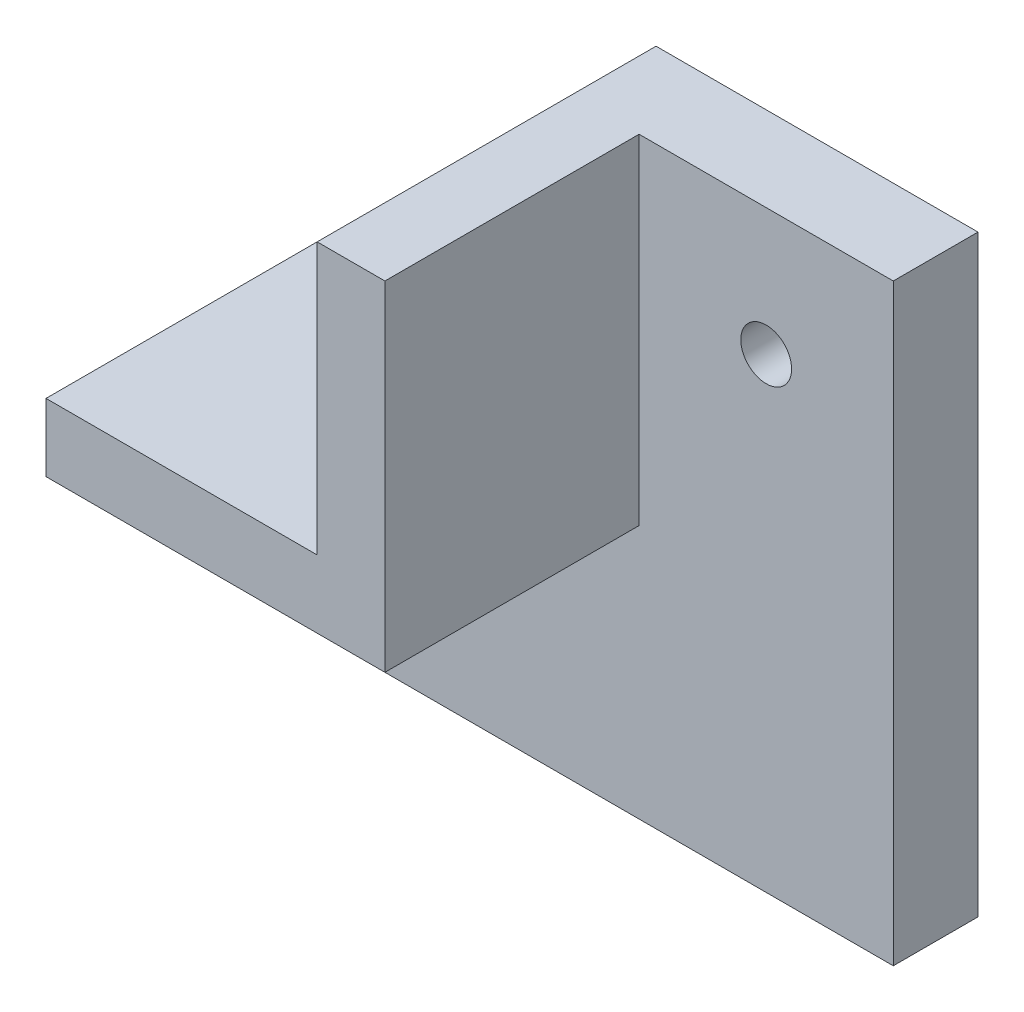
ISO-10303-21;
HEADER;
FILE_DESCRIPTION(('STEP AP214'),'2;1');
FILE_NAME('part.step','',(''),(''),'','','');
FILE_SCHEMA(('AUTOMOTIVE_DESIGN { 1 0 10303 214 1 1 1 1 }'));
ENDSEC;
DATA;
#1=APPLICATION_CONTEXT('core data for automotive mechanical design processes');
#2=APPLICATION_PROTOCOL_DEFINITION('international standard','automotive_design',2000,#1);
#3=PRODUCT_CONTEXT('',#1,'mechanical');
#4=PRODUCT('Part','Part','',(#3));
#5=PRODUCT_RELATED_PRODUCT_CATEGORY('part','',(#4));
#6=PRODUCT_DEFINITION_FORMATION('','',#4);
#7=PRODUCT_DEFINITION_CONTEXT('part definition',#1,'design');
#8=PRODUCT_DEFINITION('design','',#6,#7);
#9=PRODUCT_DEFINITION_SHAPE('','',#8);
#10=(LENGTH_UNIT() NAMED_UNIT(*) SI_UNIT(.MILLI.,.METRE.));
#11=(NAMED_UNIT(*) PLANE_ANGLE_UNIT() SI_UNIT($,.RADIAN.));
#12=(NAMED_UNIT(*) SI_UNIT($,.STERADIAN.) SOLID_ANGLE_UNIT());
#13=UNCERTAINTY_MEASURE_WITH_UNIT(LENGTH_MEASURE(1.E-05),#10,'distance_accuracy_value','');
#14=(GEOMETRIC_REPRESENTATION_CONTEXT(3) GLOBAL_UNCERTAINTY_ASSIGNED_CONTEXT((#13)) GLOBAL_UNIT_ASSIGNED_CONTEXT((#10,
#11,#12)) REPRESENTATION_CONTEXT('',''));
#15=CARTESIAN_POINT('',(0.,0.,0.));
#16=DIRECTION('',(0.,0.,1.));
#17=DIRECTION('',(1.,0.,0.));
#18=AXIS2_PLACEMENT_3D('',#15,#16,#17);
#19=CARTESIAN_POINT('',(-20.6862745098039,-4.26470588235294,5.));
#20=DIRECTION('',(1.,0.,0.));
#21=DIRECTION('',(0.,1.,0.));
#22=AXIS2_PLACEMENT_3D('',#19,#20,#21);
#23=PLANE('',#22);
#24=DIRECTION('',(0.,-1.,0.));
#25=VECTOR('',#24,1.);
#26=CARTESIAN_POINT('',(-20.6862745098039,-4.26470588235294,0.));
#27=LINE('',#26,#25);
#28=CARTESIAN_POINT('',(-20.6862745098039,-0.264705882352941,0.));
#29=VERTEX_POINT('',#28);
#30=CARTESIAN_POINT('',(-20.6862745098039,-19.2647058823529,0.));
#31=VERTEX_POINT('',#30);
#32=EDGE_CURVE('E130',#29,#31,#27,.T.);
#33=ORIENTED_EDGE('',*,*,#32,.T.);
#34=DIRECTION('',(0.,0.,-1.));
#35=VECTOR('',#34,1.);
#36=CARTESIAN_POINT('',(-20.6862745098039,-19.2647058823529,5.));
#37=LINE('',#36,#35);
#38=CARTESIAN_POINT('',(-20.6862745098039,-19.2647058823529,5.));
#39=VERTEX_POINT('',#38);
#40=EDGE_CURVE('E11',#39,#31,#37,.T.);
#41=ORIENTED_EDGE('',*,*,#40,.F.);
#42=DIRECTION('',(0.,-1.,0.));
#43=VECTOR('',#42,1.);
#44=CARTESIAN_POINT('',(-20.6862745098039,-4.26470588235294,5.));
#45=LINE('',#44,#43);
#46=CARTESIAN_POINT('',(-20.6862745098039,-4.26470588235294,5.));
#47=VERTEX_POINT('',#46);
#48=EDGE_CURVE('E124',#47,#39,#45,.T.);
#49=ORIENTED_EDGE('',*,*,#48,.F.);
#50=DIRECTION('',(0.,0.,-1.));
#51=VECTOR('',#50,1.);
#52=CARTESIAN_POINT('',(-20.6862745098039,-4.26470588235294,20.));
#53=LINE('',#52,#51);
#54=CARTESIAN_POINT('',(-20.6862745098039,-4.26470588235294,20.));
#55=VERTEX_POINT('',#54);
#56=EDGE_CURVE('E111',#55,#47,#53,.T.);
#57=ORIENTED_EDGE('',*,*,#56,.F.);
#58=DIRECTION('',(0.,1.,0.));
#59=VECTOR('',#58,1.);
#60=CARTESIAN_POINT('',(-20.6862745098039,-4.26470588235294,20.));
#61=LINE('',#60,#59);
#62=CARTESIAN_POINT('',(-20.6862745098039,-0.264705882352941,20.));
#63=VERTEX_POINT('',#62);
#64=EDGE_CURVE('E149',#55,#63,#61,.T.);
#65=ORIENTED_EDGE('',*,*,#64,.T.);
#66=DIRECTION('',(0.,0.,-1.));
#67=VECTOR('',#66,1.);
#68=CARTESIAN_POINT('',(-20.6862745098039,-0.264705882352941,20.));
#69=LINE('',#68,#67);
#70=EDGE_CURVE('E120',#63,#29,#69,.T.);
#71=ORIENTED_EDGE('',*,*,#70,.T.);
#72=EDGE_LOOP('',(#33,#41,#49,#57,#65,#71));
#73=FACE_BOUND('',#72,.T.);
#74=ADVANCED_FACE('F33',(#73),#23,.F.);
#75=CARTESIAN_POINT('',(-20.6862745098039,-19.2647058823529,5.));
#76=DIRECTION('',(0.,1.,0.));
#77=DIRECTION('',(0.,0.,1.));
#78=AXIS2_PLACEMENT_3D('',#75,#76,#77);
#79=PLANE('',#78);
#80=DIRECTION('',(1.,0.,0.));
#81=VECTOR('',#80,1.);
#82=CARTESIAN_POINT('',(-20.6862745098039,-19.2647058823529,0.));
#83=LINE('',#82,#81);
#84=CARTESIAN_POINT('',(14.3137254901961,-19.2647058823529,0.));
#85=VERTEX_POINT('',#84);
#86=EDGE_CURVE('E133',#31,#85,#83,.T.);
#87=ORIENTED_EDGE('',*,*,#86,.T.);
#88=DIRECTION('',(0.,0.,-1.));
#89=VECTOR('',#88,1.);
#90=CARTESIAN_POINT('',(14.3137254901961,-19.2647058823529,20.));
#91=LINE('',#90,#89);
#92=CARTESIAN_POINT('',(14.3137254901961,-19.2647058823529,5.));
#93=VERTEX_POINT('',#92);
#94=EDGE_CURVE('E154',#93,#85,#91,.T.);
#95=ORIENTED_EDGE('',*,*,#94,.F.);
#96=DIRECTION('',(1.,0.,0.));
#97=VECTOR('',#96,1.);
#98=CARTESIAN_POINT('',(-20.6862745098039,-19.2647058823529,5.));
#99=LINE('',#98,#97);
#100=EDGE_CURVE('E75',#39,#93,#99,.T.);
#101=ORIENTED_EDGE('',*,*,#100,.F.);
#102=ORIENTED_EDGE('',*,*,#40,.T.);
#103=EDGE_LOOP('',(#87,#95,#101,#102));
#104=FACE_BOUND('',#103,.T.);
#105=ADVANCED_FACE('F189',(#104),#79,.F.);
#106=CARTESIAN_POINT('',(14.3137254901961,15.7352941176471,5.));
#107=DIRECTION('',(-1.,0.,0.));
#108=DIRECTION('',(0.,-1.,0.));
#109=AXIS2_PLACEMENT_3D('',#106,#107,#108);
#110=PLANE('',#109);
#111=DIRECTION('',(0.,1.,0.));
#112=VECTOR('',#111,1.);
#113=CARTESIAN_POINT('',(14.3137254901961,15.7352941176471,0.));
#114=LINE('',#113,#112);
#115=CARTESIAN_POINT('',(14.3137254901961,15.7352941176471,0.));
#116=VERTEX_POINT('',#115);
#117=EDGE_CURVE('E47',#85,#116,#114,.T.);
#118=ORIENTED_EDGE('',*,*,#117,.T.);
#119=DIRECTION('',(0.,0.,-1.));
#120=VECTOR('',#119,1.);
#121=CARTESIAN_POINT('',(14.3137254901961,15.7352941176471,5.));
#122=LINE('',#121,#120);
#123=CARTESIAN_POINT('',(14.3137254901961,15.7352941176471,5.));
#124=VERTEX_POINT('',#123);
#125=EDGE_CURVE('E40',#124,#116,#122,.T.);
#126=ORIENTED_EDGE('',*,*,#125,.F.);
#127=DIRECTION('',(0.,1.,0.));
#128=VECTOR('',#127,1.);
#129=CARTESIAN_POINT('',(14.3137254901961,15.7352941176471,5.));
#130=LINE('',#129,#128);
#131=EDGE_CURVE('E88',#93,#124,#130,.T.);
#132=ORIENTED_EDGE('',*,*,#131,.F.);
#133=ORIENTED_EDGE('',*,*,#94,.T.);
#134=EDGE_LOOP('',(#118,#126,#132,#133));
#135=FACE_BOUND('',#134,.T.);
#136=ADVANCED_FACE('F188',(#135),#110,.F.);
#137=CARTESIAN_POINT('',(-0.686274509803913,15.7352941176471,5.));
#138=DIRECTION('',(0.,-1.,0.));
#139=DIRECTION('',(0.,0.,-1.));
#140=AXIS2_PLACEMENT_3D('',#137,#138,#139);
#141=PLANE('',#140);
#142=DIRECTION('',(-1.,0.,0.));
#143=VECTOR('',#142,1.);
#144=CARTESIAN_POINT('',(-0.686274509803913,15.7352941176471,0.));
#145=LINE('',#144,#143);
#146=CARTESIAN_POINT('',(-4.68627450980391,15.7352941176471,0.));
#147=VERTEX_POINT('',#146);
#148=EDGE_CURVE('E126',#116,#147,#145,.T.);
#149=ORIENTED_EDGE('',*,*,#148,.T.);
#150=DIRECTION('',(0.,0.,-1.));
#151=VECTOR('',#150,1.);
#152=CARTESIAN_POINT('',(-4.68627450980391,15.7352941176471,20.));
#153=LINE('',#152,#151);
#154=CARTESIAN_POINT('',(-4.68627450980391,15.7352941176471,20.));
#155=VERTEX_POINT('',#154);
#156=EDGE_CURVE('E109',#155,#147,#153,.T.);
#157=ORIENTED_EDGE('',*,*,#156,.F.);
#158=DIRECTION('',(-1.,0.,0.));
#159=VECTOR('',#158,1.);
#160=CARTESIAN_POINT('',(-0.686274509803913,15.7352941176471,20.));
#161=LINE('',#160,#159);
#162=CARTESIAN_POINT('',(-0.686274509803913,15.7352941176471,20.));
#163=VERTEX_POINT('',#162);
#164=EDGE_CURVE('E107',#163,#155,#161,.T.);
#165=ORIENTED_EDGE('',*,*,#164,.F.);
#166=DIRECTION('',(0.,0.,-1.));
#167=VECTOR('',#166,1.);
#168=CARTESIAN_POINT('',(-0.686274509803913,15.7352941176471,20.));
#169=LINE('',#168,#167);
#170=CARTESIAN_POINT('',(-0.686274509803913,15.7352941176471,5.));
#171=VERTEX_POINT('',#170);
#172=EDGE_CURVE('E98',#163,#171,#169,.T.);
#173=ORIENTED_EDGE('',*,*,#172,.T.);
#174=DIRECTION('',(-1.,0.,0.));
#175=VECTOR('',#174,1.);
#176=CARTESIAN_POINT('',(-0.686274509803913,15.7352941176471,5.));
#177=LINE('',#176,#175);
#178=EDGE_CURVE('E83',#124,#171,#177,.T.);
#179=ORIENTED_EDGE('',*,*,#178,.F.);
#180=ORIENTED_EDGE('',*,*,#125,.T.);
#181=EDGE_LOOP('',(#149,#157,#165,#173,#179,#180));
#182=FACE_BOUND('',#181,.T.);
#183=ADVANCED_FACE('F104',(#182),#141,.F.);
#184=CARTESIAN_POINT('',(0.,0.,5.));
#185=DIRECTION('',(0.,0.,1.));
#186=DIRECTION('',(1.,0.,0.));
#187=AXIS2_PLACEMENT_3D('',#184,#185,#186);
#188=PLANE('',#187);
#189=CARTESIAN_POINT('',(6.81372549019609,8.23529411764706,5.));
#190=DIRECTION('',(0.,0.,1.));
#191=DIRECTION('',(1.,0.,0.));
#192=AXIS2_PLACEMENT_3D('',#189,#190,#191);
#193=CIRCLE('',#192,1.5);
#194=CARTESIAN_POINT('',(8.31372549019609,8.23529411764706,5.));
#195=VERTEX_POINT('',#194);
#196=EDGE_CURVE('E190',#195,#195,#193,.T.);
#197=ORIENTED_EDGE('',*,*,#196,.F.);
#198=EDGE_LOOP('',(#197));
#199=FACE_BOUND('',#198,.T.);
#200=CARTESIAN_POINT('',(-13.1862745098039,-11.7647058823529,5.));
#201=DIRECTION('',(0.,0.,1.));
#202=DIRECTION('',(1.,0.,0.));
#203=AXIS2_PLACEMENT_3D('',#200,#201,#202);
#204=CIRCLE('',#203,1.5);
#205=CARTESIAN_POINT('',(-11.6862745098039,-11.7647058823529,5.));
#206=VERTEX_POINT('',#205);
#207=EDGE_CURVE('E202',#206,#206,#204,.T.);
#208=ORIENTED_EDGE('',*,*,#207,.F.);
#209=EDGE_LOOP('',(#208));
#210=FACE_BOUND('',#209,.T.);
#211=ORIENTED_EDGE('',*,*,#100,.T.);
#212=ORIENTED_EDGE('',*,*,#131,.T.);
#213=ORIENTED_EDGE('',*,*,#178,.T.);
#214=DIRECTION('',(0.,-1.,0.));
#215=VECTOR('',#214,1.);
#216=CARTESIAN_POINT('',(-0.686274509803913,15.7352941176471,5.));
#217=LINE('',#216,#215);
#218=CARTESIAN_POINT('',(-0.68627450980391,-4.26470588235294,5.));
#219=VERTEX_POINT('',#218);
#220=EDGE_CURVE('E86',#171,#219,#217,.T.);
#221=ORIENTED_EDGE('',*,*,#220,.T.);
#222=DIRECTION('',(-1.,0.,0.));
#223=VECTOR('',#222,1.);
#224=CARTESIAN_POINT('',(-20.6862745098039,-4.26470588235294,5.));
#225=LINE('',#224,#223);
#226=EDGE_CURVE('E56',#219,#47,#225,.T.);
#227=ORIENTED_EDGE('',*,*,#226,.T.);
#228=ORIENTED_EDGE('',*,*,#48,.T.);
#229=EDGE_LOOP('',(#211,#212,#213,#221,#227,#228));
#230=FACE_BOUND('',#229,.T.);
#231=ADVANCED_FACE('F85',(#199,#210,#230),#188,.T.);
#232=CARTESIAN_POINT('',(0.,0.,0.));
#233=DIRECTION('',(0.,0.,1.));
#234=DIRECTION('',(1.,0.,0.));
#235=AXIS2_PLACEMENT_3D('',#232,#233,#234);
#236=PLANE('',#235);
#237=CARTESIAN_POINT('',(6.81372549019609,8.23529411764706,0.));
#238=DIRECTION('',(0.,0.,-1.));
#239=DIRECTION('',(-1.,0.,0.));
#240=AXIS2_PLACEMENT_3D('',#237,#238,#239);
#241=CIRCLE('',#240,1.5);
#242=CARTESIAN_POINT('',(5.31372549019609,8.23529411764706,0.));
#243=VERTEX_POINT('',#242);
#244=EDGE_CURVE('E205',#243,#243,#241,.T.);
#245=ORIENTED_EDGE('',*,*,#244,.F.);
#246=EDGE_LOOP('',(#245));
#247=FACE_BOUND('',#246,.T.);
#248=CARTESIAN_POINT('',(-13.1862745098039,-11.7647058823529,0.));
#249=DIRECTION('',(0.,0.,-1.));
#250=DIRECTION('',(-1.,0.,0.));
#251=AXIS2_PLACEMENT_3D('',#248,#249,#250);
#252=CIRCLE('',#251,1.5);
#253=CARTESIAN_POINT('',(-14.6862745098039,-11.7647058823529,0.));
#254=VERTEX_POINT('',#253);
#255=EDGE_CURVE('E206',#254,#254,#252,.T.);
#256=ORIENTED_EDGE('',*,*,#255,.F.);
#257=EDGE_LOOP('',(#256));
#258=FACE_BOUND('',#257,.T.);
#259=ORIENTED_EDGE('',*,*,#117,.F.);
#260=ORIENTED_EDGE('',*,*,#86,.F.);
#261=ORIENTED_EDGE('',*,*,#32,.F.);
#262=DIRECTION('',(1.,0.,0.));
#263=VECTOR('',#262,1.);
#264=CARTESIAN_POINT('',(-6.07997052750672,-0.264705882352943,0.));
#265=LINE('',#264,#263);
#266=CARTESIAN_POINT('',(-4.68627450980391,-0.264705882352945,0.));
#267=VERTEX_POINT('',#266);
#268=EDGE_CURVE('E145',#29,#267,#265,.T.);
#269=ORIENTED_EDGE('',*,*,#268,.T.);
#270=DIRECTION('',(0.,-1.,0.));
#271=VECTOR('',#270,1.);
#272=CARTESIAN_POINT('',(-4.68627450980391,15.7352941176471,0.));
#273=LINE('',#272,#271);
#274=EDGE_CURVE('E141',#147,#267,#273,.T.);
#275=ORIENTED_EDGE('',*,*,#274,.F.);
#276=ORIENTED_EDGE('',*,*,#148,.F.);
#277=EDGE_LOOP('',(#259,#260,#261,#269,#275,#276));
#278=FACE_BOUND('',#277,.T.);
#279=ADVANCED_FACE('F138',(#247,#258,#278),#236,.F.);
#280=CARTESIAN_POINT('',(-20.6862745098039,-4.26470588235294,20.));
#281=DIRECTION('',(0.,1.,0.));
#282=DIRECTION('',(-1.,0.,0.));
#283=AXIS2_PLACEMENT_3D('',#280,#281,#282);
#284=PLANE('',#283);
#285=ORIENTED_EDGE('',*,*,#226,.F.);
#286=DIRECTION('',(0.,0.,-1.));
#287=VECTOR('',#286,1.);
#288=CARTESIAN_POINT('',(-0.686274509803916,-4.26470588235294,20.));
#289=LINE('',#288,#287);
#290=CARTESIAN_POINT('',(-0.686274509803916,-4.26470588235294,20.));
#291=VERTEX_POINT('',#290);
#292=EDGE_CURVE('E101',#291,#219,#289,.T.);
#293=ORIENTED_EDGE('',*,*,#292,.F.);
#294=DIRECTION('',(1.,0.,0.));
#295=VECTOR('',#294,1.);
#296=CARTESIAN_POINT('',(-20.6862745098039,-4.26470588235294,20.));
#297=LINE('',#296,#295);
#298=EDGE_CURVE('E123',#55,#291,#297,.T.);
#299=ORIENTED_EDGE('',*,*,#298,.F.);
#300=ORIENTED_EDGE('',*,*,#56,.T.);
#301=EDGE_LOOP('',(#285,#293,#299,#300));
#302=FACE_BOUND('',#301,.T.);
#303=ADVANCED_FACE('F161',(#302),#284,.F.);
#304=CARTESIAN_POINT('',(-0.686274509803913,15.7352941176471,20.));
#305=DIRECTION('',(1.,0.,0.));
#306=DIRECTION('',(0.,1.,0.));
#307=AXIS2_PLACEMENT_3D('',#304,#305,#306);
#308=PLANE('',#307);
#309=ORIENTED_EDGE('',*,*,#292,.T.);
#310=ORIENTED_EDGE('',*,*,#220,.F.);
#311=ORIENTED_EDGE('',*,*,#172,.F.);
#312=DIRECTION('',(0.,-1.,0.));
#313=VECTOR('',#312,1.);
#314=CARTESIAN_POINT('',(-0.686274509803913,15.7352941176471,20.));
#315=LINE('',#314,#313);
#316=EDGE_CURVE('E198',#163,#291,#315,.T.);
#317=ORIENTED_EDGE('',*,*,#316,.T.);
#318=EDGE_LOOP('',(#309,#310,#311,#317));
#319=FACE_BOUND('',#318,.T.);
#320=ADVANCED_FACE('F95',(#319),#308,.T.);
#321=CARTESIAN_POINT('',(-4.68627450980391,15.7352941176471,20.));
#322=DIRECTION('',(1.,0.,0.));
#323=DIRECTION('',(0.,1.,0.));
#324=AXIS2_PLACEMENT_3D('',#321,#322,#323);
#325=PLANE('',#324);
#326=ORIENTED_EDGE('',*,*,#274,.T.);
#327=DIRECTION('',(0.,0.,-1.));
#328=VECTOR('',#327,1.);
#329=CARTESIAN_POINT('',(-4.68627450980391,-0.264705882352945,20.));
#330=LINE('',#329,#328);
#331=CARTESIAN_POINT('',(-4.68627450980391,-0.264705882352945,20.));
#332=VERTEX_POINT('',#331);
#333=EDGE_CURVE('E114',#332,#267,#330,.T.);
#334=ORIENTED_EDGE('',*,*,#333,.F.);
#335=DIRECTION('',(0.,-1.,0.));
#336=VECTOR('',#335,1.);
#337=CARTESIAN_POINT('',(-4.68627450980391,15.7352941176471,20.));
#338=LINE('',#337,#336);
#339=EDGE_CURVE('E183',#155,#332,#338,.T.);
#340=ORIENTED_EDGE('',*,*,#339,.F.);
#341=ORIENTED_EDGE('',*,*,#156,.T.);
#342=EDGE_LOOP('',(#326,#334,#340,#341));
#343=FACE_BOUND('',#342,.T.);
#344=ADVANCED_FACE('F181',(#343),#325,.F.);
#345=CARTESIAN_POINT('',(-6.07997052750672,-0.264705882352943,20.));
#346=DIRECTION('',(0.,1.,0.));
#347=DIRECTION('',(-1.,0.,0.));
#348=AXIS2_PLACEMENT_3D('',#345,#346,#347);
#349=PLANE('',#348);
#350=ORIENTED_EDGE('',*,*,#268,.F.);
#351=ORIENTED_EDGE('',*,*,#70,.F.);
#352=DIRECTION('',(1.,0.,0.));
#353=VECTOR('',#352,1.);
#354=CARTESIAN_POINT('',(-20.6862745098039,-0.264705882352941,20.));
#355=LINE('',#354,#353);
#356=EDGE_CURVE('E152',#63,#332,#355,.T.);
#357=ORIENTED_EDGE('',*,*,#356,.T.);
#358=ORIENTED_EDGE('',*,*,#333,.T.);
#359=EDGE_LOOP('',(#350,#351,#357,#358));
#360=FACE_BOUND('',#359,.T.);
#361=ADVANCED_FACE('F175',(#360),#349,.T.);
#362=CARTESIAN_POINT('',(0.,0.,20.));
#363=DIRECTION('',(0.,0.,-1.));
#364=DIRECTION('',(-1.,0.,0.));
#365=AXIS2_PLACEMENT_3D('',#362,#363,#364);
#366=PLANE('',#365);
#367=ORIENTED_EDGE('',*,*,#64,.F.);
#368=ORIENTED_EDGE('',*,*,#298,.T.);
#369=ORIENTED_EDGE('',*,*,#316,.F.);
#370=ORIENTED_EDGE('',*,*,#164,.T.);
#371=ORIENTED_EDGE('',*,*,#339,.T.);
#372=ORIENTED_EDGE('',*,*,#356,.F.);
#373=EDGE_LOOP('',(#367,#368,#369,#370,#371,#372));
#374=FACE_BOUND('',#373,.T.);
#375=ADVANCED_FACE('F193',(#374),#366,.F.);
#376=CARTESIAN_POINT('',(-13.1862745098039,-11.7647058823529,20.));
#377=DIRECTION('',(0.,0.,-1.));
#378=DIRECTION('',(-1.,0.,0.));
#379=AXIS2_PLACEMENT_3D('',#376,#377,#378);
#380=CYLINDRICAL_SURFACE('',#379,1.5);
#381=ORIENTED_EDGE('',*,*,#207,.T.);
#382=EDGE_LOOP('',(#381));
#383=FACE_BOUND('',#382,.T.);
#384=ORIENTED_EDGE('',*,*,#255,.T.);
#385=EDGE_LOOP('',(#384));
#386=FACE_BOUND('',#385,.T.);
#387=ADVANCED_FACE('F219',(#383,#386),#380,.F.);
#388=CARTESIAN_POINT('',(6.81372549019609,8.23529411764706,20.));
#389=DIRECTION('',(0.,0.,-1.));
#390=DIRECTION('',(-1.,0.,0.));
#391=AXIS2_PLACEMENT_3D('',#388,#389,#390);
#392=CYLINDRICAL_SURFACE('',#391,1.5);
#393=ORIENTED_EDGE('',*,*,#196,.T.);
#394=EDGE_LOOP('',(#393));
#395=FACE_BOUND('',#394,.T.);
#396=ORIENTED_EDGE('',*,*,#244,.T.);
#397=EDGE_LOOP('',(#396));
#398=FACE_BOUND('',#397,.T.);
#399=ADVANCED_FACE('F212',(#395,#398),#392,.F.);
#400=CLOSED_SHELL('',(#74,#105,#136,#183,#231,#279,#303,#320,#344,#361,#375,#387,#399));
#401=MANIFOLD_SOLID_BREP('B2',#400);
#402=ADVANCED_BREP_SHAPE_REPRESENTATION('',(#18,#401),#14);
#403=SHAPE_DEFINITION_REPRESENTATION(#9,#402);
ENDSEC;
END-ISO-10303-21;
